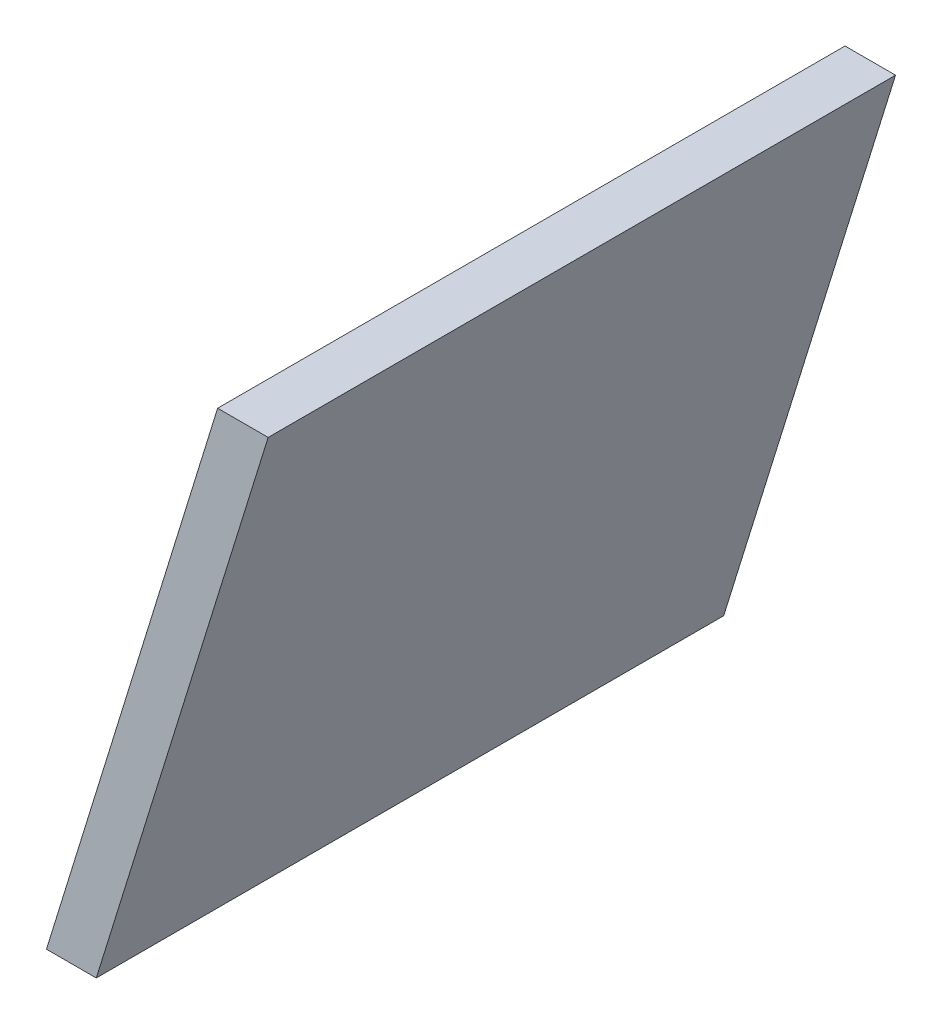
ISO-10303-21;
HEADER;
FILE_DESCRIPTION(('STEP AP214'),'2;1');
FILE_NAME('part.step','',(''),(''),'','','');
FILE_SCHEMA(('AUTOMOTIVE_DESIGN { 1 0 10303 214 1 1 1 1 }'));
ENDSEC;
DATA;
#1=APPLICATION_CONTEXT('core data for automotive mechanical design processes');
#2=APPLICATION_PROTOCOL_DEFINITION('international standard','automotive_design',2000,#1);
#3=PRODUCT_CONTEXT('',#1,'mechanical');
#4=PRODUCT('Part','Part','',(#3));
#5=PRODUCT_RELATED_PRODUCT_CATEGORY('part','',(#4));
#6=PRODUCT_DEFINITION_FORMATION('','',#4);
#7=PRODUCT_DEFINITION_CONTEXT('part definition',#1,'design');
#8=PRODUCT_DEFINITION('design','',#6,#7);
#9=PRODUCT_DEFINITION_SHAPE('','',#8);
#10=(LENGTH_UNIT() NAMED_UNIT(*) SI_UNIT(.MILLI.,.METRE.));
#11=(NAMED_UNIT(*) PLANE_ANGLE_UNIT() SI_UNIT($,.RADIAN.));
#12=(NAMED_UNIT(*) SI_UNIT($,.STERADIAN.) SOLID_ANGLE_UNIT());
#13=UNCERTAINTY_MEASURE_WITH_UNIT(LENGTH_MEASURE(1.E-05),#10,'distance_accuracy_value','');
#14=(GEOMETRIC_REPRESENTATION_CONTEXT(3) GLOBAL_UNCERTAINTY_ASSIGNED_CONTEXT((#13)) GLOBAL_UNIT_ASSIGNED_CONTEXT((#10,
#11,#12)) REPRESENTATION_CONTEXT('',''));
#15=CARTESIAN_POINT('',(0.,0.,0.));
#16=DIRECTION('',(0.,0.,1.));
#17=DIRECTION('',(1.,0.,0.));
#18=AXIS2_PLACEMENT_3D('',#15,#16,#17);
#19=CARTESIAN_POINT('',(0.739729024051158,-0.587117191321801,0.));
#20=DIRECTION('',(0.,-1.,0.));
#21=DIRECTION('',(1.,0.,0.));
#22=AXIS2_PLACEMENT_3D('',#19,#20,#21);
#23=PLANE('',#22);
#24=DIRECTION('',(-1.,0.,0.));
#25=VECTOR('',#24,1.);
#26=CARTESIAN_POINT('',(0.747670677456745,-0.587117191321801,0.));
#27=LINE('',#26,#25);
#28=CARTESIAN_POINT('',(0.747670677456745,-0.587117191321801,0.));
#29=VERTEX_POINT('',#28);
#30=CARTESIAN_POINT('',(0.739729024051158,-0.587117191321801,0.));
#31=VERTEX_POINT('',#30);
#32=EDGE_CURVE('E11',#29,#31,#27,.T.);
#33=ORIENTED_EDGE('',*,*,#32,.F.);
#34=DIRECTION('',(0.,0.,1.));
#35=VECTOR('',#34,1.);
#36=CARTESIAN_POINT('',(0.747670677456745,-0.587117191321801,0.));
#37=LINE('',#36,#35);
#38=CARTESIAN_POINT('',(0.747670677456745,-0.587117191321801,0.1));
#39=VERTEX_POINT('',#38);
#40=EDGE_CURVE('E88',#29,#39,#37,.T.);
#41=ORIENTED_EDGE('',*,*,#40,.T.);
#42=DIRECTION('',(1.,0.,0.));
#43=VECTOR('',#42,1.);
#44=CARTESIAN_POINT('',(0.739729024051158,-0.587117191321801,0.1));
#45=LINE('',#44,#43);
#46=CARTESIAN_POINT('',(0.739729024051158,-0.587117191321801,0.1));
#47=VERTEX_POINT('',#46);
#48=EDGE_CURVE('E77',#47,#39,#45,.T.);
#49=ORIENTED_EDGE('',*,*,#48,.F.);
#50=DIRECTION('',(0.,0.,1.));
#51=VECTOR('',#50,1.);
#52=CARTESIAN_POINT('',(0.739729024051158,-0.587117191321801,0.));
#53=LINE('',#52,#51);
#54=EDGE_CURVE('E84',#31,#47,#53,.T.);
#55=ORIENTED_EDGE('',*,*,#54,.F.);
#56=EDGE_LOOP('',(#33,#41,#49,#55));
#57=FACE_BOUND('',#56,.T.);
#58=ADVANCED_FACE('F17',(#57),#23,.T.);
#59=CARTESIAN_POINT('',(0.767014276108923,-0.49879466023253,0.));
#60=DIRECTION('',(-0.955446700268406,0.295163688393772,0.));
#61=DIRECTION('',(-0.295163688393772,-0.955446700268405,0.));
#62=AXIS2_PLACEMENT_3D('',#59,#60,#61);
#63=PLANE('',#62);
#64=DIRECTION('',(0.295163688393772,0.955446700268406,0.));
#65=VECTOR('',#64,1.);
#66=CARTESIAN_POINT('',(0.739729024051158,-0.587117191321801,0.));
#67=LINE('',#66,#65);
#68=CARTESIAN_POINT('',(0.767014276108923,-0.49879466023253,0.));
#69=VERTEX_POINT('',#68);
#70=EDGE_CURVE('E24',#31,#69,#67,.T.);
#71=ORIENTED_EDGE('',*,*,#70,.F.);
#72=ORIENTED_EDGE('',*,*,#54,.T.);
#73=DIRECTION('',(-0.295163688393773,-0.955446700268405,0.));
#74=VECTOR('',#73,1.);
#75=CARTESIAN_POINT('',(0.767014276108923,-0.49879466023253,0.1));
#76=LINE('',#75,#74);
#77=CARTESIAN_POINT('',(0.767014276108923,-0.49879466023253,0.1));
#78=VERTEX_POINT('',#77);
#79=EDGE_CURVE('E65',#78,#47,#76,.T.);
#80=ORIENTED_EDGE('',*,*,#79,.F.);
#81=DIRECTION('',(0.,0.,1.));
#82=VECTOR('',#81,1.);
#83=CARTESIAN_POINT('',(0.767014276108923,-0.49879466023253,0.));
#84=LINE('',#83,#82);
#85=EDGE_CURVE('E70',#69,#78,#84,.T.);
#86=ORIENTED_EDGE('',*,*,#85,.F.);
#87=EDGE_LOOP('',(#71,#72,#80,#86));
#88=FACE_BOUND('',#87,.T.);
#89=ADVANCED_FACE('F91',(#88),#63,.T.);
#90=CARTESIAN_POINT('',(0.775069381706018,-0.49879466023253,0.));
#91=DIRECTION('',(0.,1.,0.));
#92=DIRECTION('',(-1.,0.,0.));
#93=AXIS2_PLACEMENT_3D('',#90,#91,#92);
#94=PLANE('',#93);
#95=DIRECTION('',(1.,0.,0.));
#96=VECTOR('',#95,1.);
#97=CARTESIAN_POINT('',(0.767014276108923,-0.49879466023253,0.));
#98=LINE('',#97,#96);
#99=CARTESIAN_POINT('',(0.775069381706018,-0.49879466023253,0.));
#100=VERTEX_POINT('',#99);
#101=EDGE_CURVE('E86',#69,#100,#98,.T.);
#102=ORIENTED_EDGE('',*,*,#101,.F.);
#103=ORIENTED_EDGE('',*,*,#85,.T.);
#104=DIRECTION('',(-1.,0.,0.));
#105=VECTOR('',#104,1.);
#106=CARTESIAN_POINT('',(0.775069381706018,-0.49879466023253,0.1));
#107=LINE('',#106,#105);
#108=CARTESIAN_POINT('',(0.775069381706018,-0.49879466023253,0.1));
#109=VERTEX_POINT('',#108);
#110=EDGE_CURVE('E66',#109,#78,#107,.T.);
#111=ORIENTED_EDGE('',*,*,#110,.F.);
#112=DIRECTION('',(0.,0.,1.));
#113=VECTOR('',#112,1.);
#114=CARTESIAN_POINT('',(0.775069381706018,-0.49879466023253,0.));
#115=LINE('',#114,#113);
#116=EDGE_CURVE('E55',#100,#109,#115,.T.);
#117=ORIENTED_EDGE('',*,*,#116,.F.);
#118=EDGE_LOOP('',(#102,#103,#111,#117));
#119=FACE_BOUND('',#118,.T.);
#120=ADVANCED_FACE('F69',(#119),#94,.T.);
#121=CARTESIAN_POINT('',(0.747670677456745,-0.587117191321801,0.));
#122=DIRECTION('',(0.955100056972452,-0.296283447345982,0.));
#123=DIRECTION('',(0.296283447345982,0.955100056972452,0.));
#124=AXIS2_PLACEMENT_3D('',#121,#122,#123);
#125=PLANE('',#124);
#126=DIRECTION('',(-0.296283447345982,-0.955100056972452,0.));
#127=VECTOR('',#126,1.);
#128=CARTESIAN_POINT('',(0.775069381706018,-0.49879466023253,0.));
#129=LINE('',#128,#127);
#130=EDGE_CURVE('E62',#100,#29,#129,.T.);
#131=ORIENTED_EDGE('',*,*,#130,.F.);
#132=ORIENTED_EDGE('',*,*,#116,.T.);
#133=DIRECTION('',(0.296283447345982,0.955100056972452,0.));
#134=VECTOR('',#133,1.);
#135=CARTESIAN_POINT('',(0.747670677456745,-0.587117191321801,0.1));
#136=LINE('',#135,#134);
#137=EDGE_CURVE('E60',#39,#109,#136,.T.);
#138=ORIENTED_EDGE('',*,*,#137,.F.);
#139=ORIENTED_EDGE('',*,*,#40,.F.);
#140=EDGE_LOOP('',(#131,#132,#138,#139));
#141=FACE_BOUND('',#140,.T.);
#142=ADVANCED_FACE('F57',(#141),#125,.T.);
#143=CARTESIAN_POINT('',(0.757379227455306,-0.542930988589131,0.));
#144=DIRECTION('',(0.,0.,1.));
#145=DIRECTION('',(1.,0.,0.));
#146=AXIS2_PLACEMENT_3D('',#143,#144,#145);
#147=PLANE('',#146);
#148=ORIENTED_EDGE('',*,*,#130,.T.);
#149=ORIENTED_EDGE('',*,*,#32,.T.);
#150=ORIENTED_EDGE('',*,*,#70,.T.);
#151=ORIENTED_EDGE('',*,*,#101,.T.);
#152=EDGE_LOOP('',(#148,#149,#150,#151));
#153=FACE_BOUND('',#152,.T.);
#154=ADVANCED_FACE('F90',(#153),#147,.F.);
#155=CARTESIAN_POINT('',(0.757379227455306,-0.542930988589131,0.1));
#156=DIRECTION('',(0.,0.,1.));
#157=DIRECTION('',(1.,0.,0.));
#158=AXIS2_PLACEMENT_3D('',#155,#156,#157);
#159=PLANE('',#158);
#160=ORIENTED_EDGE('',*,*,#137,.T.);
#161=ORIENTED_EDGE('',*,*,#110,.T.);
#162=ORIENTED_EDGE('',*,*,#79,.T.);
#163=ORIENTED_EDGE('',*,*,#48,.T.);
#164=EDGE_LOOP('',(#160,#161,#162,#163));
#165=FACE_BOUND('',#164,.T.);
#166=ADVANCED_FACE('F75',(#165),#159,.T.);
#167=CLOSED_SHELL('',(#58,#89,#120,#142,#154,#166));
#168=MANIFOLD_SOLID_BREP('B1',#167);
#169=ADVANCED_BREP_SHAPE_REPRESENTATION('',(#18,#168),#14);
#170=SHAPE_DEFINITION_REPRESENTATION(#9,#169);
ENDSEC;
END-ISO-10303-21;
